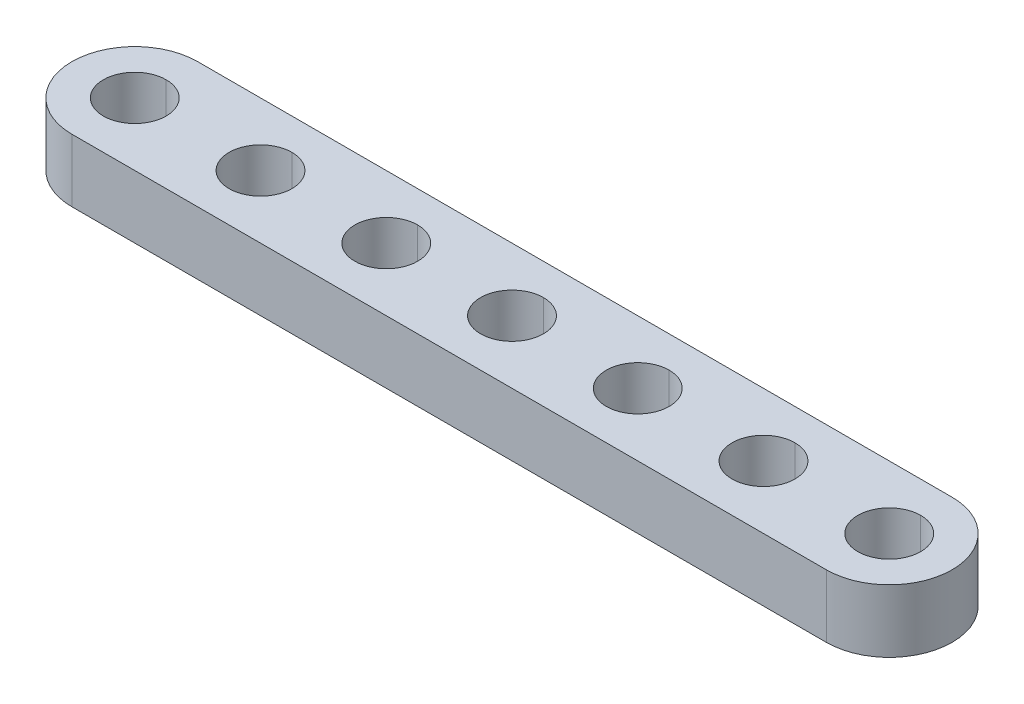
ISO-10303-21;
HEADER;
FILE_DESCRIPTION(('STEP AP214'),'2;1');
FILE_NAME('part.step','',(''),(''),'','','');
FILE_SCHEMA(('AUTOMOTIVE_DESIGN { 1 0 10303 214 1 1 1 1 }'));
ENDSEC;
DATA;
#1=APPLICATION_CONTEXT('core data for automotive mechanical design processes');
#2=APPLICATION_PROTOCOL_DEFINITION('international standard','automotive_design',2000,#1);
#3=PRODUCT_CONTEXT('',#1,'mechanical');
#4=PRODUCT('Part','Part','',(#3));
#5=PRODUCT_RELATED_PRODUCT_CATEGORY('part','',(#4));
#6=PRODUCT_DEFINITION_FORMATION('','',#4);
#7=PRODUCT_DEFINITION_CONTEXT('part definition',#1,'design');
#8=PRODUCT_DEFINITION('design','',#6,#7);
#9=PRODUCT_DEFINITION_SHAPE('','',#8);
#10=(LENGTH_UNIT() NAMED_UNIT(*) SI_UNIT(.MILLI.,.METRE.));
#11=(NAMED_UNIT(*) PLANE_ANGLE_UNIT() SI_UNIT($,.RADIAN.));
#12=(NAMED_UNIT(*) SI_UNIT($,.STERADIAN.) SOLID_ANGLE_UNIT());
#13=UNCERTAINTY_MEASURE_WITH_UNIT(LENGTH_MEASURE(1.E-05),#10,'distance_accuracy_value','');
#14=(GEOMETRIC_REPRESENTATION_CONTEXT(3) GLOBAL_UNCERTAINTY_ASSIGNED_CONTEXT((#13)) GLOBAL_UNIT_ASSIGNED_CONTEXT((#10,
#11,#12)) REPRESENTATION_CONTEXT('',''));
#15=CARTESIAN_POINT('',(0.,0.,0.));
#16=DIRECTION('',(0.,0.,1.));
#17=DIRECTION('',(1.,0.,0.));
#18=AXIS2_PLACEMENT_3D('',#15,#16,#17);
#19=CARTESIAN_POINT('',(24.,4.,0.));
#20=DIRECTION('',(0.,1.,0.));
#21=DIRECTION('',(0.,0.,1.));
#22=AXIS2_PLACEMENT_3D('',#19,#20,#21);
#23=CYLINDRICAL_SURFACE('',#22,2.);
#24=DIRECTION('',(0.,1.,0.));
#25=VECTOR('',#24,1.);
#26=CARTESIAN_POINT('',(24.,4.,-2.));
#27=LINE('',#26,#25);
#28=CARTESIAN_POINT('',(24.,0.,-2.));
#29=VERTEX_POINT('',#28);
#30=CARTESIAN_POINT('',(24.,4.,-2.));
#31=VERTEX_POINT('',#30);
#32=EDGE_CURVE('E241',#29,#31,#27,.T.);
#33=ORIENTED_EDGE('',*,*,#32,.F.);
#34=CARTESIAN_POINT('',(24.,0.,0.));
#35=DIRECTION('',(0.,1.,0.));
#36=DIRECTION('',(0.,0.,1.));
#37=AXIS2_PLACEMENT_3D('',#34,#35,#36);
#38=CIRCLE('',#37,2.);
#39=CARTESIAN_POINT('',(24.,0.,2.));
#40=VERTEX_POINT('',#39);
#41=EDGE_CURVE('E248',#40,#29,#38,.T.);
#42=ORIENTED_EDGE('',*,*,#41,.F.);
#43=DIRECTION('',(0.,1.,0.));
#44=VECTOR('',#43,1.);
#45=CARTESIAN_POINT('',(24.,4.,2.));
#46=LINE('',#45,#44);
#47=CARTESIAN_POINT('',(24.,4.,2.));
#48=VERTEX_POINT('',#47);
#49=EDGE_CURVE('E340',#40,#48,#46,.T.);
#50=ORIENTED_EDGE('',*,*,#49,.T.);
#51=CARTESIAN_POINT('',(24.,4.,0.));
#52=DIRECTION('',(0.,1.,0.));
#53=DIRECTION('',(0.,0.,1.));
#54=AXIS2_PLACEMENT_3D('',#51,#52,#53);
#55=CIRCLE('',#54,2.);
#56=EDGE_CURVE('E242',#48,#31,#55,.T.);
#57=ORIENTED_EDGE('',*,*,#56,.T.);
#58=EDGE_LOOP('',(#33,#42,#50,#57));
#59=FACE_BOUND('',#58,.T.);
#60=ADVANCED_FACE('F16',(#59),#23,.F.);
#61=CARTESIAN_POINT('',(16.,4.,0.));
#62=DIRECTION('',(0.,1.,0.));
#63=DIRECTION('',(0.,0.,1.));
#64=AXIS2_PLACEMENT_3D('',#61,#62,#63);
#65=CYLINDRICAL_SURFACE('',#64,2.);
#66=DIRECTION('',(0.,1.,0.));
#67=VECTOR('',#66,1.);
#68=CARTESIAN_POINT('',(16.,4.,-2.));
#69=LINE('',#68,#67);
#70=CARTESIAN_POINT('',(16.,0.,-2.));
#71=VERTEX_POINT('',#70);
#72=CARTESIAN_POINT('',(16.,4.,-2.));
#73=VERTEX_POINT('',#72);
#74=EDGE_CURVE('E345',#71,#73,#69,.T.);
#75=ORIENTED_EDGE('',*,*,#74,.F.);
#76=CARTESIAN_POINT('',(16.,0.,0.));
#77=DIRECTION('',(0.,1.,0.));
#78=DIRECTION('',(0.,0.,1.));
#79=AXIS2_PLACEMENT_3D('',#76,#77,#78);
#80=CIRCLE('',#79,2.);
#81=CARTESIAN_POINT('',(16.,0.,2.));
#82=VERTEX_POINT('',#81);
#83=EDGE_CURVE('E230',#82,#71,#80,.T.);
#84=ORIENTED_EDGE('',*,*,#83,.F.);
#85=DIRECTION('',(0.,1.,0.));
#86=VECTOR('',#85,1.);
#87=CARTESIAN_POINT('',(16.,4.,2.));
#88=LINE('',#87,#86);
#89=CARTESIAN_POINT('',(16.,4.,2.));
#90=VERTEX_POINT('',#89);
#91=EDGE_CURVE('E284',#82,#90,#88,.T.);
#92=ORIENTED_EDGE('',*,*,#91,.T.);
#93=CARTESIAN_POINT('',(16.,4.,0.));
#94=DIRECTION('',(0.,1.,0.));
#95=DIRECTION('',(0.,0.,1.));
#96=AXIS2_PLACEMENT_3D('',#93,#94,#95);
#97=CIRCLE('',#96,2.);
#98=EDGE_CURVE('E245',#90,#73,#97,.T.);
#99=ORIENTED_EDGE('',*,*,#98,.T.);
#100=EDGE_LOOP('',(#75,#84,#92,#99));
#101=FACE_BOUND('',#100,.T.);
#102=ADVANCED_FACE('F392',(#101),#65,.F.);
#103=CARTESIAN_POINT('',(8.,4.,0.));
#104=DIRECTION('',(0.,1.,0.));
#105=DIRECTION('',(0.,0.,1.));
#106=AXIS2_PLACEMENT_3D('',#103,#104,#105);
#107=CYLINDRICAL_SURFACE('',#106,2.);
#108=DIRECTION('',(0.,1.,0.));
#109=VECTOR('',#108,1.);
#110=CARTESIAN_POINT('',(8.,4.,-2.));
#111=LINE('',#110,#109);
#112=CARTESIAN_POINT('',(8.,0.,-2.));
#113=VERTEX_POINT('',#112);
#114=CARTESIAN_POINT('',(8.,4.,-2.));
#115=VERTEX_POINT('',#114);
#116=EDGE_CURVE('E20',#113,#115,#111,.T.);
#117=ORIENTED_EDGE('',*,*,#116,.F.);
#118=CARTESIAN_POINT('',(8.,0.,0.));
#119=DIRECTION('',(0.,1.,0.));
#120=DIRECTION('',(0.,0.,1.));
#121=AXIS2_PLACEMENT_3D('',#118,#119,#120);
#122=CIRCLE('',#121,2.);
#123=CARTESIAN_POINT('',(8.,0.,2.));
#124=VERTEX_POINT('',#123);
#125=EDGE_CURVE('E226',#124,#113,#122,.T.);
#126=ORIENTED_EDGE('',*,*,#125,.F.);
#127=DIRECTION('',(0.,1.,0.));
#128=VECTOR('',#127,1.);
#129=CARTESIAN_POINT('',(8.,4.,2.));
#130=LINE('',#129,#128);
#131=CARTESIAN_POINT('',(8.,4.,2.));
#132=VERTEX_POINT('',#131);
#133=EDGE_CURVE('E214',#124,#132,#130,.T.);
#134=ORIENTED_EDGE('',*,*,#133,.T.);
#135=CARTESIAN_POINT('',(8.,4.,0.));
#136=DIRECTION('',(0.,1.,0.));
#137=DIRECTION('',(0.,0.,1.));
#138=AXIS2_PLACEMENT_3D('',#135,#136,#137);
#139=CIRCLE('',#138,2.);
#140=EDGE_CURVE('E266',#132,#115,#139,.T.);
#141=ORIENTED_EDGE('',*,*,#140,.T.);
#142=EDGE_LOOP('',(#117,#126,#134,#141));
#143=FACE_BOUND('',#142,.T.);
#144=ADVANCED_FACE('F397',(#143),#107,.F.);
#145=CARTESIAN_POINT('',(0.,4.,0.));
#146=DIRECTION('',(0.,1.,0.));
#147=DIRECTION('',(0.,0.,1.));
#148=AXIS2_PLACEMENT_3D('',#145,#146,#147);
#149=CYLINDRICAL_SURFACE('',#148,2.);
#150=DIRECTION('',(0.,1.,0.));
#151=VECTOR('',#150,1.);
#152=CARTESIAN_POINT('',(0.,4.,-2.));
#153=LINE('',#152,#151);
#154=CARTESIAN_POINT('',(0.,0.,-2.));
#155=VERTEX_POINT('',#154);
#156=CARTESIAN_POINT('',(0.,4.,-2.));
#157=VERTEX_POINT('',#156);
#158=EDGE_CURVE('E258',#155,#157,#153,.T.);
#159=ORIENTED_EDGE('',*,*,#158,.F.);
#160=CARTESIAN_POINT('',(0.,0.,0.));
#161=DIRECTION('',(0.,1.,0.));
#162=DIRECTION('',(0.,0.,1.));
#163=AXIS2_PLACEMENT_3D('',#160,#161,#162);
#164=CIRCLE('',#163,2.);
#165=CARTESIAN_POINT('',(0.,0.,2.));
#166=VERTEX_POINT('',#165);
#167=EDGE_CURVE('E229',#166,#155,#164,.T.);
#168=ORIENTED_EDGE('',*,*,#167,.F.);
#169=DIRECTION('',(0.,1.,0.));
#170=VECTOR('',#169,1.);
#171=CARTESIAN_POINT('',(0.,4.,2.));
#172=LINE('',#171,#170);
#173=CARTESIAN_POINT('',(0.,4.,2.));
#174=VERTEX_POINT('',#173);
#175=EDGE_CURVE('E289',#166,#174,#172,.T.);
#176=ORIENTED_EDGE('',*,*,#175,.T.);
#177=CARTESIAN_POINT('',(0.,4.,0.));
#178=DIRECTION('',(0.,1.,0.));
#179=DIRECTION('',(0.,0.,1.));
#180=AXIS2_PLACEMENT_3D('',#177,#178,#179);
#181=CIRCLE('',#180,2.);
#182=EDGE_CURVE('E189',#174,#157,#181,.T.);
#183=ORIENTED_EDGE('',*,*,#182,.T.);
#184=EDGE_LOOP('',(#159,#168,#176,#183));
#185=FACE_BOUND('',#184,.T.);
#186=ADVANCED_FACE('F404',(#185),#149,.F.);
#187=CARTESIAN_POINT('',(-8.,4.,0.));
#188=DIRECTION('',(0.,1.,0.));
#189=DIRECTION('',(0.,0.,1.));
#190=AXIS2_PLACEMENT_3D('',#187,#188,#189);
#191=CYLINDRICAL_SURFACE('',#190,2.);
#192=DIRECTION('',(0.,1.,0.));
#193=VECTOR('',#192,1.);
#194=CARTESIAN_POINT('',(-8.,4.,-2.));
#195=LINE('',#194,#193);
#196=CARTESIAN_POINT('',(-8.,0.,-2.));
#197=VERTEX_POINT('',#196);
#198=CARTESIAN_POINT('',(-8.,4.,-2.));
#199=VERTEX_POINT('',#198);
#200=EDGE_CURVE('E202',#197,#199,#195,.T.);
#201=ORIENTED_EDGE('',*,*,#200,.F.);
#202=CARTESIAN_POINT('',(-8.,0.,0.));
#203=DIRECTION('',(0.,1.,0.));
#204=DIRECTION('',(0.,0.,1.));
#205=AXIS2_PLACEMENT_3D('',#202,#203,#204);
#206=CIRCLE('',#205,2.);
#207=CARTESIAN_POINT('',(-8.,0.,2.));
#208=VERTEX_POINT('',#207);
#209=EDGE_CURVE('E194',#208,#197,#206,.T.);
#210=ORIENTED_EDGE('',*,*,#209,.F.);
#211=DIRECTION('',(0.,1.,0.));
#212=VECTOR('',#211,1.);
#213=CARTESIAN_POINT('',(-8.,4.,2.));
#214=LINE('',#213,#212);
#215=CARTESIAN_POINT('',(-8.,4.,2.));
#216=VERTEX_POINT('',#215);
#217=EDGE_CURVE('E192',#208,#216,#214,.T.);
#218=ORIENTED_EDGE('',*,*,#217,.T.);
#219=CARTESIAN_POINT('',(-8.,4.,0.));
#220=DIRECTION('',(0.,1.,0.));
#221=DIRECTION('',(0.,0.,1.));
#222=AXIS2_PLACEMENT_3D('',#219,#220,#221);
#223=CIRCLE('',#222,2.);
#224=EDGE_CURVE('E178',#216,#199,#223,.T.);
#225=ORIENTED_EDGE('',*,*,#224,.T.);
#226=EDGE_LOOP('',(#201,#210,#218,#225));
#227=FACE_BOUND('',#226,.T.);
#228=ADVANCED_FACE('F193',(#227),#191,.F.);
#229=CARTESIAN_POINT('',(-16.,4.,0.));
#230=DIRECTION('',(0.,1.,0.));
#231=DIRECTION('',(0.,0.,1.));
#232=AXIS2_PLACEMENT_3D('',#229,#230,#231);
#233=CYLINDRICAL_SURFACE('',#232,2.);
#234=DIRECTION('',(0.,1.,0.));
#235=VECTOR('',#234,1.);
#236=CARTESIAN_POINT('',(-16.,4.,-2.));
#237=LINE('',#236,#235);
#238=CARTESIAN_POINT('',(-16.,0.,-2.));
#239=VERTEX_POINT('',#238);
#240=CARTESIAN_POINT('',(-16.,4.,-2.));
#241=VERTEX_POINT('',#240);
#242=EDGE_CURVE('E263',#239,#241,#237,.T.);
#243=ORIENTED_EDGE('',*,*,#242,.F.);
#244=CARTESIAN_POINT('',(-16.,0.,0.));
#245=DIRECTION('',(0.,1.,0.));
#246=DIRECTION('',(0.,0.,1.));
#247=AXIS2_PLACEMENT_3D('',#244,#245,#246);
#248=CIRCLE('',#247,2.);
#249=CARTESIAN_POINT('',(-16.,0.,2.));
#250=VERTEX_POINT('',#249);
#251=EDGE_CURVE('E27',#250,#239,#248,.T.);
#252=ORIENTED_EDGE('',*,*,#251,.F.);
#253=DIRECTION('',(0.,1.,0.));
#254=VECTOR('',#253,1.);
#255=CARTESIAN_POINT('',(-16.,4.,2.));
#256=LINE('',#255,#254);
#257=CARTESIAN_POINT('',(-16.,4.,2.));
#258=VERTEX_POINT('',#257);
#259=EDGE_CURVE('E236',#250,#258,#256,.T.);
#260=ORIENTED_EDGE('',*,*,#259,.T.);
#261=CARTESIAN_POINT('',(-16.,4.,0.));
#262=DIRECTION('',(0.,1.,0.));
#263=DIRECTION('',(0.,0.,1.));
#264=AXIS2_PLACEMENT_3D('',#261,#262,#263);
#265=CIRCLE('',#264,2.);
#266=EDGE_CURVE('E188',#258,#241,#265,.T.);
#267=ORIENTED_EDGE('',*,*,#266,.T.);
#268=EDGE_LOOP('',(#243,#252,#260,#267));
#269=FACE_BOUND('',#268,.T.);
#270=ADVANCED_FACE('F424',(#269),#233,.F.);
#271=CARTESIAN_POINT('',(-24.,4.,0.));
#272=DIRECTION('',(0.,1.,0.));
#273=DIRECTION('',(0.,0.,1.));
#274=AXIS2_PLACEMENT_3D('',#271,#272,#273);
#275=CYLINDRICAL_SURFACE('',#274,2.);
#276=DIRECTION('',(0.,1.,0.));
#277=VECTOR('',#276,1.);
#278=CARTESIAN_POINT('',(-24.,4.,-2.));
#279=LINE('',#278,#277);
#280=CARTESIAN_POINT('',(-24.,0.,-2.));
#281=VERTEX_POINT('',#280);
#282=CARTESIAN_POINT('',(-24.,4.,-2.));
#283=VERTEX_POINT('',#282);
#284=EDGE_CURVE('E216',#281,#283,#279,.T.);
#285=ORIENTED_EDGE('',*,*,#284,.F.);
#286=CARTESIAN_POINT('',(-24.,0.,0.));
#287=DIRECTION('',(0.,1.,0.));
#288=DIRECTION('',(0.,0.,1.));
#289=AXIS2_PLACEMENT_3D('',#286,#287,#288);
#290=CIRCLE('',#289,2.);
#291=CARTESIAN_POINT('',(-24.,0.,2.));
#292=VERTEX_POINT('',#291);
#293=EDGE_CURVE('E10',#292,#281,#290,.T.);
#294=ORIENTED_EDGE('',*,*,#293,.F.);
#295=DIRECTION('',(0.,1.,0.));
#296=VECTOR('',#295,1.);
#297=CARTESIAN_POINT('',(-24.,4.,2.));
#298=LINE('',#297,#296);
#299=CARTESIAN_POINT('',(-24.,4.,2.));
#300=VERTEX_POINT('',#299);
#301=EDGE_CURVE('E267',#292,#300,#298,.T.);
#302=ORIENTED_EDGE('',*,*,#301,.T.);
#303=CARTESIAN_POINT('',(-24.,4.,0.));
#304=DIRECTION('',(0.,1.,0.));
#305=DIRECTION('',(0.,0.,1.));
#306=AXIS2_PLACEMENT_3D('',#303,#304,#305);
#307=CIRCLE('',#306,2.);
#308=EDGE_CURVE('E251',#300,#283,#307,.T.);
#309=ORIENTED_EDGE('',*,*,#308,.T.);
#310=EDGE_LOOP('',(#285,#294,#302,#309));
#311=FACE_BOUND('',#310,.T.);
#312=ADVANCED_FACE('F416',(#311),#275,.F.);
#313=CARTESIAN_POINT('',(-24.,0.,0.));
#314=DIRECTION('',(0.,1.,0.));
#315=DIRECTION('',(1.,0.,0.));
#316=AXIS2_PLACEMENT_3D('',#313,#314,#315);
#317=PLANE('',#316);
#318=ORIENTED_EDGE('',*,*,#293,.T.);
#319=CARTESIAN_POINT('',(-24.,0.,0.));
#320=DIRECTION('',(0.,1.,0.));
#321=DIRECTION('',(0.,0.,1.));
#322=AXIS2_PLACEMENT_3D('',#319,#320,#321);
#323=CIRCLE('',#322,2.);
#324=EDGE_CURVE('E219',#281,#292,#323,.T.);
#325=ORIENTED_EDGE('',*,*,#324,.T.);
#326=EDGE_LOOP('',(#318,#325));
#327=FACE_BOUND('',#326,.T.);
#328=ORIENTED_EDGE('',*,*,#251,.T.);
#329=CARTESIAN_POINT('',(-16.,0.,0.));
#330=DIRECTION('',(0.,1.,0.));
#331=DIRECTION('',(0.,0.,1.));
#332=AXIS2_PLACEMENT_3D('',#329,#330,#331);
#333=CIRCLE('',#332,2.);
#334=EDGE_CURVE('E199',#239,#250,#333,.T.);
#335=ORIENTED_EDGE('',*,*,#334,.T.);
#336=EDGE_LOOP('',(#328,#335));
#337=FACE_BOUND('',#336,.T.);
#338=ORIENTED_EDGE('',*,*,#209,.T.);
#339=CARTESIAN_POINT('',(-8.,0.,0.));
#340=DIRECTION('',(0.,1.,0.));
#341=DIRECTION('',(0.,0.,1.));
#342=AXIS2_PLACEMENT_3D('',#339,#340,#341);
#343=CIRCLE('',#342,2.);
#344=EDGE_CURVE('E210',#197,#208,#343,.T.);
#345=ORIENTED_EDGE('',*,*,#344,.T.);
#346=EDGE_LOOP('',(#338,#345));
#347=FACE_BOUND('',#346,.T.);
#348=ORIENTED_EDGE('',*,*,#167,.T.);
#349=CARTESIAN_POINT('',(0.,0.,0.));
#350=DIRECTION('',(0.,1.,0.));
#351=DIRECTION('',(0.,0.,1.));
#352=AXIS2_PLACEMENT_3D('',#349,#350,#351);
#353=CIRCLE('',#352,2.);
#354=EDGE_CURVE('E254',#155,#166,#353,.T.);
#355=ORIENTED_EDGE('',*,*,#354,.T.);
#356=EDGE_LOOP('',(#348,#355));
#357=FACE_BOUND('',#356,.T.);
#358=ORIENTED_EDGE('',*,*,#125,.T.);
#359=CARTESIAN_POINT('',(8.,0.,0.));
#360=DIRECTION('',(0.,1.,0.));
#361=DIRECTION('',(0.,0.,1.));
#362=AXIS2_PLACEMENT_3D('',#359,#360,#361);
#363=CIRCLE('',#362,2.);
#364=EDGE_CURVE('E280',#113,#124,#363,.T.);
#365=ORIENTED_EDGE('',*,*,#364,.T.);
#366=EDGE_LOOP('',(#358,#365));
#367=FACE_BOUND('',#366,.T.);
#368=ORIENTED_EDGE('',*,*,#83,.T.);
#369=CARTESIAN_POINT('',(16.,0.,0.));
#370=DIRECTION('',(0.,1.,0.));
#371=DIRECTION('',(0.,0.,1.));
#372=AXIS2_PLACEMENT_3D('',#369,#370,#371);
#373=CIRCLE('',#372,2.);
#374=EDGE_CURVE('E344',#71,#82,#373,.T.);
#375=ORIENTED_EDGE('',*,*,#374,.T.);
#376=EDGE_LOOP('',(#368,#375));
#377=FACE_BOUND('',#376,.T.);
#378=ORIENTED_EDGE('',*,*,#41,.T.);
#379=CARTESIAN_POINT('',(24.,0.,0.));
#380=DIRECTION('',(0.,1.,0.));
#381=DIRECTION('',(0.,0.,1.));
#382=AXIS2_PLACEMENT_3D('',#379,#380,#381);
#383=CIRCLE('',#382,2.);
#384=EDGE_CURVE('E237',#29,#40,#383,.T.);
#385=ORIENTED_EDGE('',*,*,#384,.T.);
#386=EDGE_LOOP('',(#378,#385));
#387=FACE_BOUND('',#386,.T.);
#388=CARTESIAN_POINT('',(-24.,0.,0.));
#389=DIRECTION('',(0.,1.,0.));
#390=DIRECTION('',(0.,0.,1.));
#391=AXIS2_PLACEMENT_3D('',#388,#389,#390);
#392=CIRCLE('',#391,4.);
#393=CARTESIAN_POINT('',(-24.,0.,-4.));
#394=VERTEX_POINT('',#393);
#395=CARTESIAN_POINT('',(-24.,0.,4.));
#396=VERTEX_POINT('',#395);
#397=EDGE_CURVE('E271',#394,#396,#392,.T.);
#398=ORIENTED_EDGE('',*,*,#397,.F.);
#399=DIRECTION('',(-1.,0.,0.));
#400=VECTOR('',#399,1.);
#401=CARTESIAN_POINT('',(-24.,0.,-4.));
#402=LINE('',#401,#400);
#403=CARTESIAN_POINT('',(24.,0.,-4.));
#404=VERTEX_POINT('',#403);
#405=EDGE_CURVE('E290',#404,#394,#402,.T.);
#406=ORIENTED_EDGE('',*,*,#405,.F.);
#407=CARTESIAN_POINT('',(24.,0.,0.));
#408=DIRECTION('',(0.,1.,0.));
#409=DIRECTION('',(0.,0.,1.));
#410=AXIS2_PLACEMENT_3D('',#407,#408,#409);
#411=CIRCLE('',#410,4.);
#412=CARTESIAN_POINT('',(24.,0.,4.));
#413=VERTEX_POINT('',#412);
#414=EDGE_CURVE('E225',#413,#404,#411,.T.);
#415=ORIENTED_EDGE('',*,*,#414,.F.);
#416=DIRECTION('',(1.,0.,0.));
#417=VECTOR('',#416,1.);
#418=CARTESIAN_POINT('',(-24.,0.,4.));
#419=LINE('',#418,#417);
#420=EDGE_CURVE('E318',#396,#413,#419,.T.);
#421=ORIENTED_EDGE('',*,*,#420,.F.);
#422=EDGE_LOOP('',(#398,#406,#415,#421));
#423=FACE_BOUND('',#422,.T.);
#424=ADVANCED_FACE('F374',(#327,#337,#347,#357,#367,#377,#387,#423),#317,.F.);
#425=CARTESIAN_POINT('',(-24.,4.,0.));
#426=DIRECTION('',(0.,1.,0.));
#427=DIRECTION('',(1.,0.,0.));
#428=AXIS2_PLACEMENT_3D('',#425,#426,#427);
#429=PLANE('',#428);
#430=ORIENTED_EDGE('',*,*,#308,.F.);
#431=CARTESIAN_POINT('',(-24.,4.,0.));
#432=DIRECTION('',(0.,1.,0.));
#433=DIRECTION('',(0.,0.,1.));
#434=AXIS2_PLACEMENT_3D('',#431,#432,#433);
#435=CIRCLE('',#434,2.);
#436=EDGE_CURVE('E218',#283,#300,#435,.T.);
#437=ORIENTED_EDGE('',*,*,#436,.F.);
#438=EDGE_LOOP('',(#430,#437));
#439=FACE_BOUND('',#438,.T.);
#440=ORIENTED_EDGE('',*,*,#266,.F.);
#441=CARTESIAN_POINT('',(-16.,4.,0.));
#442=DIRECTION('',(0.,1.,0.));
#443=DIRECTION('',(0.,0.,1.));
#444=AXIS2_PLACEMENT_3D('',#441,#442,#443);
#445=CIRCLE('',#444,2.);
#446=EDGE_CURVE('E259',#241,#258,#445,.T.);
#447=ORIENTED_EDGE('',*,*,#446,.F.);
#448=EDGE_LOOP('',(#440,#447));
#449=FACE_BOUND('',#448,.T.);
#450=ORIENTED_EDGE('',*,*,#224,.F.);
#451=CARTESIAN_POINT('',(-8.,4.,0.));
#452=DIRECTION('',(0.,1.,0.));
#453=DIRECTION('',(0.,0.,1.));
#454=AXIS2_PLACEMENT_3D('',#451,#452,#453);
#455=CIRCLE('',#454,2.);
#456=EDGE_CURVE('E183',#199,#216,#455,.T.);
#457=ORIENTED_EDGE('',*,*,#456,.F.);
#458=EDGE_LOOP('',(#450,#457));
#459=FACE_BOUND('',#458,.T.);
#460=ORIENTED_EDGE('',*,*,#182,.F.);
#461=CARTESIAN_POINT('',(0.,4.,0.));
#462=DIRECTION('',(0.,1.,0.));
#463=DIRECTION('',(0.,0.,1.));
#464=AXIS2_PLACEMENT_3D('',#461,#462,#463);
#465=CIRCLE('',#464,2.);
#466=EDGE_CURVE('E285',#157,#174,#465,.T.);
#467=ORIENTED_EDGE('',*,*,#466,.F.);
#468=EDGE_LOOP('',(#460,#467));
#469=FACE_BOUND('',#468,.T.);
#470=ORIENTED_EDGE('',*,*,#140,.F.);
#471=CARTESIAN_POINT('',(8.,4.,0.));
#472=DIRECTION('',(0.,1.,0.));
#473=DIRECTION('',(0.,0.,1.));
#474=AXIS2_PLACEMENT_3D('',#471,#472,#473);
#475=CIRCLE('',#474,2.);
#476=EDGE_CURVE('E349',#115,#132,#475,.T.);
#477=ORIENTED_EDGE('',*,*,#476,.F.);
#478=EDGE_LOOP('',(#470,#477));
#479=FACE_BOUND('',#478,.T.);
#480=ORIENTED_EDGE('',*,*,#98,.F.);
#481=CARTESIAN_POINT('',(16.,4.,0.));
#482=DIRECTION('',(0.,1.,0.));
#483=DIRECTION('',(0.,0.,1.));
#484=AXIS2_PLACEMENT_3D('',#481,#482,#483);
#485=CIRCLE('',#484,2.);
#486=EDGE_CURVE('E333',#73,#90,#485,.T.);
#487=ORIENTED_EDGE('',*,*,#486,.F.);
#488=EDGE_LOOP('',(#480,#487));
#489=FACE_BOUND('',#488,.T.);
#490=ORIENTED_EDGE('',*,*,#56,.F.);
#491=CARTESIAN_POINT('',(24.,4.,0.));
#492=DIRECTION('',(0.,1.,0.));
#493=DIRECTION('',(0.,0.,1.));
#494=AXIS2_PLACEMENT_3D('',#491,#492,#493);
#495=CIRCLE('',#494,2.);
#496=EDGE_CURVE('E307',#31,#48,#495,.T.);
#497=ORIENTED_EDGE('',*,*,#496,.F.);
#498=EDGE_LOOP('',(#490,#497));
#499=FACE_BOUND('',#498,.T.);
#500=CARTESIAN_POINT('',(-24.,4.,0.));
#501=DIRECTION('',(0.,1.,0.));
#502=DIRECTION('',(0.,0.,1.));
#503=AXIS2_PLACEMENT_3D('',#500,#501,#502);
#504=CIRCLE('',#503,4.);
#505=CARTESIAN_POINT('',(-24.,4.,-4.));
#506=VERTEX_POINT('',#505);
#507=CARTESIAN_POINT('',(-24.,4.,4.));
#508=VERTEX_POINT('',#507);
#509=EDGE_CURVE('E272',#506,#508,#504,.T.);
#510=ORIENTED_EDGE('',*,*,#509,.T.);
#511=DIRECTION('',(1.,0.,0.));
#512=VECTOR('',#511,1.);
#513=CARTESIAN_POINT('',(-24.,4.,4.));
#514=LINE('',#513,#512);
#515=CARTESIAN_POINT('',(24.,4.,4.));
#516=VERTEX_POINT('',#515);
#517=EDGE_CURVE('E299',#508,#516,#514,.T.);
#518=ORIENTED_EDGE('',*,*,#517,.T.);
#519=CARTESIAN_POINT('',(24.,4.,0.));
#520=DIRECTION('',(0.,1.,0.));
#521=DIRECTION('',(0.,0.,1.));
#522=AXIS2_PLACEMENT_3D('',#519,#520,#521);
#523=CIRCLE('',#522,4.);
#524=CARTESIAN_POINT('',(24.,4.,-4.));
#525=VERTEX_POINT('',#524);
#526=EDGE_CURVE('E224',#516,#525,#523,.T.);
#527=ORIENTED_EDGE('',*,*,#526,.T.);
#528=DIRECTION('',(-1.,0.,0.));
#529=VECTOR('',#528,1.);
#530=CARTESIAN_POINT('',(-24.,4.,-4.));
#531=LINE('',#530,#529);
#532=EDGE_CURVE('E42',#525,#506,#531,.T.);
#533=ORIENTED_EDGE('',*,*,#532,.T.);
#534=EDGE_LOOP('',(#510,#518,#527,#533));
#535=FACE_BOUND('',#534,.T.);
#536=ADVANCED_FACE('F180',(#439,#449,#459,#469,#479,#489,#499,#535),#429,.T.);
#537=CARTESIAN_POINT('',(-24.,4.,-4.));
#538=DIRECTION('',(0.,0.,1.));
#539=DIRECTION('',(1.,0.,0.));
#540=AXIS2_PLACEMENT_3D('',#537,#538,#539);
#541=PLANE('',#540);
#542=ORIENTED_EDGE('',*,*,#405,.T.);
#543=DIRECTION('',(0.,-1.,0.));
#544=VECTOR('',#543,1.);
#545=CARTESIAN_POINT('',(-24.,4.,-4.));
#546=LINE('',#545,#544);
#547=EDGE_CURVE('E276',#506,#394,#546,.T.);
#548=ORIENTED_EDGE('',*,*,#547,.F.);
#549=ORIENTED_EDGE('',*,*,#532,.F.);
#550=DIRECTION('',(0.,-1.,0.));
#551=VECTOR('',#550,1.);
#552=CARTESIAN_POINT('',(24.,4.,-4.));
#553=LINE('',#552,#551);
#554=EDGE_CURVE('E221',#525,#404,#553,.T.);
#555=ORIENTED_EDGE('',*,*,#554,.T.);
#556=EDGE_LOOP('',(#542,#548,#549,#555));
#557=FACE_BOUND('',#556,.T.);
#558=ADVANCED_FACE('F18',(#557),#541,.F.);
#559=CARTESIAN_POINT('',(24.,4.,0.));
#560=DIRECTION('',(0.,-1.,0.));
#561=DIRECTION('',(0.,0.,-1.));
#562=AXIS2_PLACEMENT_3D('',#559,#560,#561);
#563=CYLINDRICAL_SURFACE('',#562,4.);
#564=ORIENTED_EDGE('',*,*,#414,.T.);
#565=ORIENTED_EDGE('',*,*,#554,.F.);
#566=ORIENTED_EDGE('',*,*,#526,.F.);
#567=DIRECTION('',(0.,-1.,0.));
#568=VECTOR('',#567,1.);
#569=CARTESIAN_POINT('',(24.,4.,4.));
#570=LINE('',#569,#568);
#571=EDGE_CURVE('E303',#516,#413,#570,.T.);
#572=ORIENTED_EDGE('',*,*,#571,.T.);
#573=EDGE_LOOP('',(#564,#565,#566,#572));
#574=FACE_BOUND('',#573,.T.);
#575=ADVANCED_FACE('F377',(#574),#563,.T.);
#576=CARTESIAN_POINT('',(-24.,4.,4.));
#577=DIRECTION('',(0.,0.,-1.));
#578=DIRECTION('',(0.,-1.,0.));
#579=AXIS2_PLACEMENT_3D('',#576,#577,#578);
#580=PLANE('',#579);
#581=ORIENTED_EDGE('',*,*,#420,.T.);
#582=ORIENTED_EDGE('',*,*,#571,.F.);
#583=ORIENTED_EDGE('',*,*,#517,.F.);
#584=DIRECTION('',(0.,-1.,0.));
#585=VECTOR('',#584,1.);
#586=CARTESIAN_POINT('',(-24.,4.,4.));
#587=LINE('',#586,#585);
#588=EDGE_CURVE('E277',#508,#396,#587,.T.);
#589=ORIENTED_EDGE('',*,*,#588,.T.);
#590=EDGE_LOOP('',(#581,#582,#583,#589));
#591=FACE_BOUND('',#590,.T.);
#592=ADVANCED_FACE('F370',(#591),#580,.F.);
#593=CARTESIAN_POINT('',(-24.,4.,0.));
#594=DIRECTION('',(0.,-1.,0.));
#595=DIRECTION('',(0.,0.,-1.));
#596=AXIS2_PLACEMENT_3D('',#593,#594,#595);
#597=CYLINDRICAL_SURFACE('',#596,4.);
#598=ORIENTED_EDGE('',*,*,#397,.T.);
#599=ORIENTED_EDGE('',*,*,#588,.F.);
#600=ORIENTED_EDGE('',*,*,#509,.F.);
#601=ORIENTED_EDGE('',*,*,#547,.T.);
#602=EDGE_LOOP('',(#598,#599,#600,#601));
#603=FACE_BOUND('',#602,.T.);
#604=ADVANCED_FACE('F381',(#603),#597,.T.);
#605=CARTESIAN_POINT('',(-24.,4.,0.));
#606=DIRECTION('',(0.,1.,0.));
#607=DIRECTION('',(0.,0.,1.));
#608=AXIS2_PLACEMENT_3D('',#605,#606,#607);
#609=CYLINDRICAL_SURFACE('',#608,2.);
#610=ORIENTED_EDGE('',*,*,#324,.F.);
#611=ORIENTED_EDGE('',*,*,#284,.T.);
#612=ORIENTED_EDGE('',*,*,#436,.T.);
#613=ORIENTED_EDGE('',*,*,#301,.F.);
#614=EDGE_LOOP('',(#610,#611,#612,#613));
#615=FACE_BOUND('',#614,.T.);
#616=ADVANCED_FACE('F409',(#615),#609,.F.);
#617=CARTESIAN_POINT('',(-16.,4.,0.));
#618=DIRECTION('',(0.,1.,0.));
#619=DIRECTION('',(0.,0.,1.));
#620=AXIS2_PLACEMENT_3D('',#617,#618,#619);
#621=CYLINDRICAL_SURFACE('',#620,2.);
#622=ORIENTED_EDGE('',*,*,#334,.F.);
#623=ORIENTED_EDGE('',*,*,#242,.T.);
#624=ORIENTED_EDGE('',*,*,#446,.T.);
#625=ORIENTED_EDGE('',*,*,#259,.F.);
#626=EDGE_LOOP('',(#622,#623,#624,#625));
#627=FACE_BOUND('',#626,.T.);
#628=ADVANCED_FACE('F406',(#627),#621,.F.);
#629=CARTESIAN_POINT('',(-8.,4.,0.));
#630=DIRECTION('',(0.,1.,0.));
#631=DIRECTION('',(0.,0.,1.));
#632=AXIS2_PLACEMENT_3D('',#629,#630,#631);
#633=CYLINDRICAL_SURFACE('',#632,2.);
#634=ORIENTED_EDGE('',*,*,#344,.F.);
#635=ORIENTED_EDGE('',*,*,#200,.T.);
#636=ORIENTED_EDGE('',*,*,#456,.T.);
#637=ORIENTED_EDGE('',*,*,#217,.F.);
#638=EDGE_LOOP('',(#634,#635,#636,#637));
#639=FACE_BOUND('',#638,.T.);
#640=ADVANCED_FACE('F201',(#639),#633,.F.);
#641=CARTESIAN_POINT('',(0.,4.,0.));
#642=DIRECTION('',(0.,1.,0.));
#643=DIRECTION('',(0.,0.,1.));
#644=AXIS2_PLACEMENT_3D('',#641,#642,#643);
#645=CYLINDRICAL_SURFACE('',#644,2.);
#646=ORIENTED_EDGE('',*,*,#354,.F.);
#647=ORIENTED_EDGE('',*,*,#158,.T.);
#648=ORIENTED_EDGE('',*,*,#466,.T.);
#649=ORIENTED_EDGE('',*,*,#175,.F.);
#650=EDGE_LOOP('',(#646,#647,#648,#649));
#651=FACE_BOUND('',#650,.T.);
#652=ADVANCED_FACE('F413',(#651),#645,.F.);
#653=CARTESIAN_POINT('',(8.,4.,0.));
#654=DIRECTION('',(0.,1.,0.));
#655=DIRECTION('',(0.,0.,1.));
#656=AXIS2_PLACEMENT_3D('',#653,#654,#655);
#657=CYLINDRICAL_SURFACE('',#656,2.);
#658=ORIENTED_EDGE('',*,*,#364,.F.);
#659=ORIENTED_EDGE('',*,*,#116,.T.);
#660=ORIENTED_EDGE('',*,*,#476,.T.);
#661=ORIENTED_EDGE('',*,*,#133,.F.);
#662=EDGE_LOOP('',(#658,#659,#660,#661));
#663=FACE_BOUND('',#662,.T.);
#664=ADVANCED_FACE('F422',(#663),#657,.F.);
#665=CARTESIAN_POINT('',(16.,4.,0.));
#666=DIRECTION('',(0.,1.,0.));
#667=DIRECTION('',(0.,0.,1.));
#668=AXIS2_PLACEMENT_3D('',#665,#666,#667);
#669=CYLINDRICAL_SURFACE('',#668,2.);
#670=ORIENTED_EDGE('',*,*,#374,.F.);
#671=ORIENTED_EDGE('',*,*,#74,.T.);
#672=ORIENTED_EDGE('',*,*,#486,.T.);
#673=ORIENTED_EDGE('',*,*,#91,.F.);
#674=EDGE_LOOP('',(#670,#671,#672,#673));
#675=FACE_BOUND('',#674,.T.);
#676=ADVANCED_FACE('F418',(#675),#669,.F.);
#677=CARTESIAN_POINT('',(24.,4.,0.));
#678=DIRECTION('',(0.,1.,0.));
#679=DIRECTION('',(0.,0.,1.));
#680=AXIS2_PLACEMENT_3D('',#677,#678,#679);
#681=CYLINDRICAL_SURFACE('',#680,2.);
#682=ORIENTED_EDGE('',*,*,#384,.F.);
#683=ORIENTED_EDGE('',*,*,#32,.T.);
#684=ORIENTED_EDGE('',*,*,#496,.T.);
#685=ORIENTED_EDGE('',*,*,#49,.F.);
#686=EDGE_LOOP('',(#682,#683,#684,#685));
#687=FACE_BOUND('',#686,.T.);
#688=ADVANCED_FACE('F421',(#687),#681,.F.);
#689=CLOSED_SHELL('',(#60,#102,#144,#186,#228,#270,#312,#424,#536,#558,#575,#592,#604,#616,#628,
#640,#652,#664,#676,#688));
#690=MANIFOLD_SOLID_BREP('B1',#689);
#691=ADVANCED_BREP_SHAPE_REPRESENTATION('',(#18,#690),#14);
#692=SHAPE_DEFINITION_REPRESENTATION(#9,#691);
ENDSEC;
END-ISO-10303-21;
